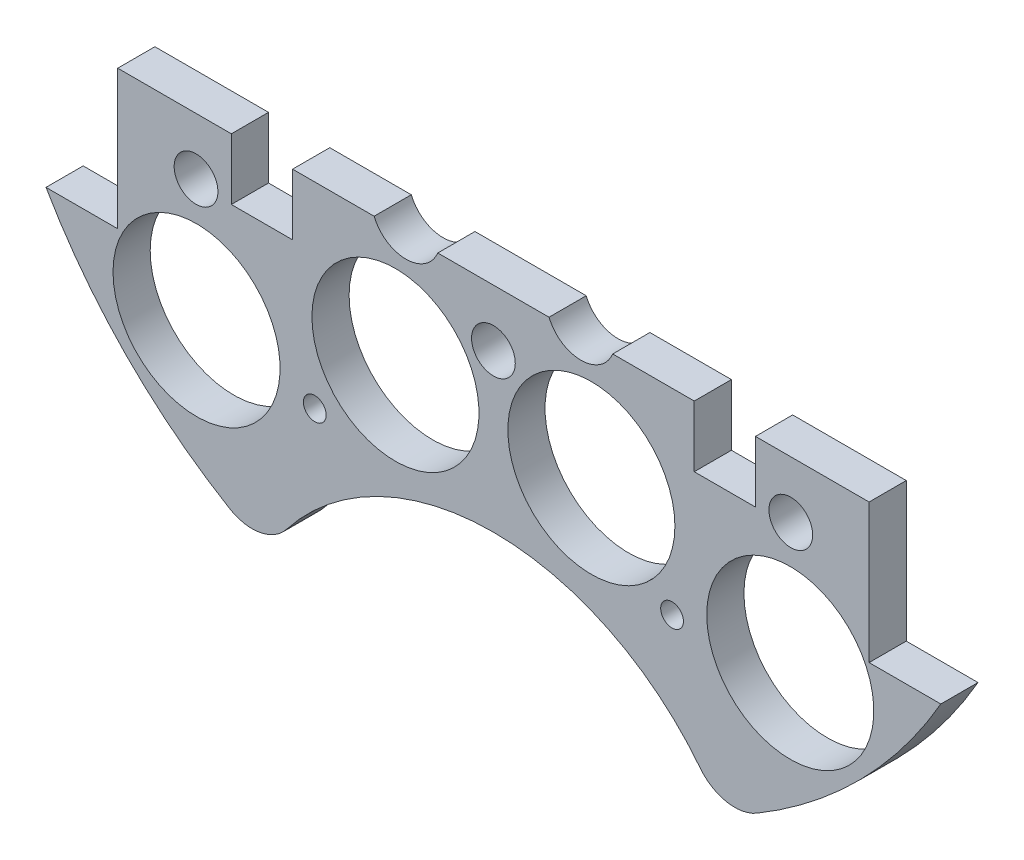
ISO-10303-21;
HEADER;
FILE_DESCRIPTION(('STEP AP214'),'2;1');
FILE_NAME('part.step','',(''),(''),'','','');
FILE_SCHEMA(('AUTOMOTIVE_DESIGN { 1 0 10303 214 1 1 1 1 }'));
ENDSEC;
DATA;
#1=APPLICATION_CONTEXT('core data for automotive mechanical design processes');
#2=APPLICATION_PROTOCOL_DEFINITION('international standard','automotive_design',2000,#1);
#3=PRODUCT_CONTEXT('',#1,'mechanical');
#4=PRODUCT('Part','Part','',(#3));
#5=PRODUCT_RELATED_PRODUCT_CATEGORY('part','',(#4));
#6=PRODUCT_DEFINITION_FORMATION('','',#4);
#7=PRODUCT_DEFINITION_CONTEXT('part definition',#1,'design');
#8=PRODUCT_DEFINITION('design','',#6,#7);
#9=PRODUCT_DEFINITION_SHAPE('','',#8);
#10=(LENGTH_UNIT() NAMED_UNIT(*) SI_UNIT(.MILLI.,.METRE.));
#11=(NAMED_UNIT(*) PLANE_ANGLE_UNIT() SI_UNIT($,.RADIAN.));
#12=(NAMED_UNIT(*) SI_UNIT($,.STERADIAN.) SOLID_ANGLE_UNIT());
#13=UNCERTAINTY_MEASURE_WITH_UNIT(LENGTH_MEASURE(1.E-05),#10,'distance_accuracy_value','');
#14=(GEOMETRIC_REPRESENTATION_CONTEXT(3) GLOBAL_UNCERTAINTY_ASSIGNED_CONTEXT((#13)) GLOBAL_UNIT_ASSIGNED_CONTEXT((#10,
#11,#12)) REPRESENTATION_CONTEXT('',''));
#15=CARTESIAN_POINT('',(0.,0.,0.));
#16=DIRECTION('',(0.,0.,1.));
#17=DIRECTION('',(1.,0.,0.));
#18=AXIS2_PLACEMENT_3D('',#15,#16,#17);
#19=CARTESIAN_POINT('',(85.0440360772851,-17.145,5.3975));
#20=DIRECTION('',(0.,-1.,0.));
#21=DIRECTION('',(0.,0.,-1.));
#22=AXIS2_PLACEMENT_3D('',#19,#20,#21);
#23=PLANE('',#22);
#24=DIRECTION('',(-1.,0.,0.));
#25=VECTOR('',#24,1.);
#26=CARTESIAN_POINT('',(85.0440360772851,-17.145,5.3975));
#27=LINE('',#26,#25);
#28=CARTESIAN_POINT('',(-17.3228751875862,-17.145,5.3975));
#29=VERTEX_POINT('',#28);
#30=CARTESIAN_POINT('',(-29.1604414737786,-17.145,5.3975));
#31=VERTEX_POINT('',#30);
#32=EDGE_CURVE('E197',#29,#31,#27,.T.);
#33=ORIENTED_EDGE('',*,*,#32,.F.);
#34=DIRECTION('',(0.,0.,-1.));
#35=VECTOR('',#34,1.);
#36=CARTESIAN_POINT('',(-17.3228751875862,-17.145,10.));
#37=LINE('',#36,#35);
#38=CARTESIAN_POINT('',(-17.3228751875862,-17.145,0.));
#39=VERTEX_POINT('',#38);
#40=EDGE_CURVE('E183',#29,#39,#37,.T.);
#41=ORIENTED_EDGE('',*,*,#40,.T.);
#42=DIRECTION('',(-1.,0.,0.));
#43=VECTOR('',#42,1.);
#44=CARTESIAN_POINT('',(85.0440360772851,-17.145,0.));
#45=LINE('',#44,#43);
#46=CARTESIAN_POINT('',(-29.1604414737786,-17.145,0.));
#47=VERTEX_POINT('',#46);
#48=EDGE_CURVE('E195',#39,#47,#45,.T.);
#49=ORIENTED_EDGE('',*,*,#48,.T.);
#50=DIRECTION('',(0.,0.,-1.));
#51=VECTOR('',#50,1.);
#52=CARTESIAN_POINT('',(-29.1604414737786,-17.145,5.3975));
#53=LINE('',#52,#51);
#54=EDGE_CURVE('E256',#31,#47,#53,.T.);
#55=ORIENTED_EDGE('',*,*,#54,.F.);
#56=EDGE_LOOP('',(#33,#41,#49,#55));
#57=FACE_BOUND('',#56,.T.);
#58=ADVANCED_FACE('F33',(#57),#23,.F.);
#59=CARTESIAN_POINT('',(8.07712481241381,-17.145,0.));
#60=VERTEX_POINT('',#59);
#61=CARTESIAN_POINT('',(-8.07712481241381,-17.145,0.));
#62=VERTEX_POINT('',#61);
#63=EDGE_CURVE('E205',#60,#62,#45,.T.);
#64=ORIENTED_EDGE('',*,*,#63,.T.);
#65=DIRECTION('',(0.,0.,-1.));
#66=VECTOR('',#65,1.);
#67=CARTESIAN_POINT('',(-8.07712481241381,-17.145,10.));
#68=LINE('',#67,#66);
#69=CARTESIAN_POINT('',(-8.07712481241381,-17.145,5.3975));
#70=VERTEX_POINT('',#69);
#71=EDGE_CURVE('E50',#62,#70,#68,.F.);
#72=ORIENTED_EDGE('',*,*,#71,.T.);
#73=CARTESIAN_POINT('',(8.07712481241381,-17.145,5.3975));
#74=VERTEX_POINT('',#73);
#75=EDGE_CURVE('E219',#74,#70,#27,.T.);
#76=ORIENTED_EDGE('',*,*,#75,.F.);
#77=DIRECTION('',(0.,0.,-1.));
#78=VECTOR('',#77,1.);
#79=CARTESIAN_POINT('',(8.07712481241381,-17.145,10.));
#80=LINE('',#79,#78);
#81=EDGE_CURVE('E238',#74,#60,#80,.T.);
#82=ORIENTED_EDGE('',*,*,#81,.T.);
#83=EDGE_LOOP('',(#64,#72,#76,#82));
#84=FACE_BOUND('',#83,.T.);
#85=ADVANCED_FACE('F304',(#84),#23,.F.);
#86=CARTESIAN_POINT('',(29.1604414737786,-17.145,0.));
#87=VERTEX_POINT('',#86);
#88=CARTESIAN_POINT('',(17.3228751875862,-17.145,0.));
#89=VERTEX_POINT('',#88);
#90=EDGE_CURVE('E209',#87,#89,#45,.T.);
#91=ORIENTED_EDGE('',*,*,#90,.T.);
#92=DIRECTION('',(0.,0.,-1.));
#93=VECTOR('',#92,1.);
#94=CARTESIAN_POINT('',(17.3228751875862,-17.145,10.));
#95=LINE('',#94,#93);
#96=CARTESIAN_POINT('',(17.3228751875862,-17.145,5.3975));
#97=VERTEX_POINT('',#96);
#98=EDGE_CURVE('E58',#89,#97,#95,.F.);
#99=ORIENTED_EDGE('',*,*,#98,.T.);
#100=CARTESIAN_POINT('',(29.1604414737786,-17.145,5.3975));
#101=VERTEX_POINT('',#100);
#102=EDGE_CURVE('E218',#101,#97,#27,.T.);
#103=ORIENTED_EDGE('',*,*,#102,.F.);
#104=DIRECTION('',(0.,0.,-1.));
#105=VECTOR('',#104,1.);
#106=CARTESIAN_POINT('',(29.1604414737786,-17.145,5.3975));
#107=LINE('',#106,#105);
#108=EDGE_CURVE('E227',#101,#87,#107,.T.);
#109=ORIENTED_EDGE('',*,*,#108,.T.);
#110=EDGE_LOOP('',(#91,#99,#103,#109));
#111=FACE_BOUND('',#110,.T.);
#112=ADVANCED_FACE('F224',(#111),#23,.F.);
#113=CARTESIAN_POINT('',(54.5504414737786,-17.145,0.));
#114=VERTEX_POINT('',#113);
#115=CARTESIAN_POINT('',(38.0504414737786,-17.145,0.));
#116=VERTEX_POINT('',#115);
#117=EDGE_CURVE('E208',#114,#116,#45,.T.);
#118=ORIENTED_EDGE('',*,*,#117,.T.);
#119=DIRECTION('',(0.,0.,-1.));
#120=VECTOR('',#119,1.);
#121=CARTESIAN_POINT('',(38.0504414737786,-17.145,5.3975));
#122=LINE('',#121,#120);
#123=CARTESIAN_POINT('',(38.0504414737786,-17.145,5.3975));
#124=VERTEX_POINT('',#123);
#125=EDGE_CURVE('E281',#124,#116,#122,.T.);
#126=ORIENTED_EDGE('',*,*,#125,.F.);
#127=CARTESIAN_POINT('',(54.5504414737786,-17.145,5.3975));
#128=VERTEX_POINT('',#127);
#129=EDGE_CURVE('E290',#128,#124,#27,.T.);
#130=ORIENTED_EDGE('',*,*,#129,.F.);
#131=DIRECTION('',(0.,0.,1.));
#132=VECTOR('',#131,1.);
#133=CARTESIAN_POINT('',(54.5504414737786,-17.145,5.3975));
#134=LINE('',#133,#132);
#135=EDGE_CURVE('E670',#114,#128,#134,.T.);
#136=ORIENTED_EDGE('',*,*,#135,.F.);
#137=EDGE_LOOP('',(#118,#126,#130,#136));
#138=FACE_BOUND('',#137,.T.);
#139=ADVANCED_FACE('F354',(#138),#23,.F.);
#140=CARTESIAN_POINT('',(0.,0.,5.3975));
#141=DIRECTION('',(0.,0.,-1.));
#142=DIRECTION('',(-1.,0.,0.));
#143=AXIS2_PLACEMENT_3D('',#140,#141,#142);
#144=CYLINDRICAL_SURFACE('',#143,74.93);
#145=CARTESIAN_POINT('',(0.,0.,0.));
#146=DIRECTION('',(0.,0.,1.));
#147=DIRECTION('',(1.,0.,0.));
#148=AXIS2_PLACEMENT_3D('',#145,#146,#147);
#149=CIRCLE('',#148,74.93);
#150=CARTESIAN_POINT('',(-64.9644414737785,-37.338,0.));
#151=VERTEX_POINT('',#150);
#152=CARTESIAN_POINT('',(-38.2787319784796,-64.4146223936749,0.));
#153=VERTEX_POINT('',#152);
#154=EDGE_CURVE('E652',#151,#153,#149,.T.);
#155=ORIENTED_EDGE('',*,*,#154,.T.);
#156=DIRECTION('',(0.,0.,-1.));
#157=VECTOR('',#156,1.);
#158=CARTESIAN_POINT('',(-38.2787319784796,-64.4146223936749,5.3975));
#159=LINE('',#158,#157);
#160=CARTESIAN_POINT('',(-38.2787319784796,-64.4146223936749,5.3975));
#161=VERTEX_POINT('',#160);
#162=EDGE_CURVE('E673',#153,#161,#159,.F.);
#163=ORIENTED_EDGE('',*,*,#162,.T.);
#164=CARTESIAN_POINT('',(0.,0.,5.3975));
#165=DIRECTION('',(0.,0.,1.));
#166=DIRECTION('',(1.,0.,0.));
#167=AXIS2_PLACEMENT_3D('',#164,#165,#166);
#168=CIRCLE('',#167,74.93);
#169=CARTESIAN_POINT('',(-64.9644414737785,-37.338,5.3975));
#170=VERTEX_POINT('',#169);
#171=EDGE_CURVE('E640',#170,#161,#168,.T.);
#172=ORIENTED_EDGE('',*,*,#171,.F.);
#173=DIRECTION('',(0.,0.,-1.));
#174=VECTOR('',#173,1.);
#175=CARTESIAN_POINT('',(-64.9644414737785,-37.338,5.3975));
#176=LINE('',#175,#174);
#177=EDGE_CURVE('E664',#170,#151,#176,.T.);
#178=ORIENTED_EDGE('',*,*,#177,.T.);
#179=EDGE_LOOP('',(#155,#163,#172,#178));
#180=FACE_BOUND('',#179,.T.);
#181=ADVANCED_FACE('F366',(#180),#144,.T.);
#182=CARTESIAN_POINT('',(0.,0.,5.3975));
#183=DIRECTION('',(0.,0.,1.));
#184=DIRECTION('',(1.,0.,0.));
#185=AXIS2_PLACEMENT_3D('',#182,#183,#184);
#186=PLANE('',#185);
#187=CARTESIAN_POINT('',(-25.9376089894497,-45.645229381132,5.3975));
#188=DIRECTION('',(0.,0.,1.));
#189=DIRECTION('',(1.,0.,0.));
#190=AXIS2_PLACEMENT_3D('',#187,#188,#189);
#191=CIRCLE('',#190,1.651);
#192=CARTESIAN_POINT('',(-24.2866089894497,-45.645229381132,5.3975));
#193=VERTEX_POINT('',#192);
#194=EDGE_CURVE('E322',#193,#193,#191,.T.);
#195=ORIENTED_EDGE('',*,*,#194,.F.);
#196=EDGE_LOOP('',(#195));
#197=FACE_BOUND('',#196,.T.);
#198=CARTESIAN_POINT('',(25.9376089894497,-45.645229381132,5.3975));
#199=DIRECTION('',(0.,0.,1.));
#200=DIRECTION('',(1.,0.,0.));
#201=AXIS2_PLACEMENT_3D('',#198,#199,#200);
#202=CIRCLE('',#201,1.651);
#203=CARTESIAN_POINT('',(27.5886089894497,-45.645229381132,5.3975));
#204=VERTEX_POINT('',#203);
#205=EDGE_CURVE('E318',#204,#204,#202,.T.);
#206=ORIENTED_EDGE('',*,*,#205,.F.);
#207=EDGE_LOOP('',(#206));
#208=FACE_BOUND('',#207,.T.);
#209=CARTESIAN_POINT('',(-43.18,-25.4,5.3975));
#210=DIRECTION('',(0.,0.,1.));
#211=DIRECTION('',(1.,0.,0.));
#212=AXIS2_PLACEMENT_3D('',#209,#210,#211);
#213=CIRCLE('',#212,3.175);
#214=CARTESIAN_POINT('',(-40.005,-25.4,5.3975));
#215=VERTEX_POINT('',#214);
#216=EDGE_CURVE('E190',#215,#215,#213,.F.);
#217=ORIENTED_EDGE('',*,*,#216,.T.);
#218=EDGE_LOOP('',(#217));
#219=FACE_BOUND('',#218,.T.);
#220=CARTESIAN_POINT('',(0.,-25.4,5.3975));
#221=DIRECTION('',(0.,0.,1.));
#222=DIRECTION('',(1.,0.,0.));
#223=AXIS2_PLACEMENT_3D('',#220,#221,#222);
#224=CIRCLE('',#223,3.175);
#225=CARTESIAN_POINT('',(3.17500000000001,-25.4,5.3975));
#226=VERTEX_POINT('',#225);
#227=EDGE_CURVE('E310',#226,#226,#224,.F.);
#228=ORIENTED_EDGE('',*,*,#227,.T.);
#229=EDGE_LOOP('',(#228));
#230=FACE_BOUND('',#229,.T.);
#231=CARTESIAN_POINT('',(43.18,-25.4,5.3975));
#232=DIRECTION('',(0.,0.,1.));
#233=DIRECTION('',(1.,0.,0.));
#234=AXIS2_PLACEMENT_3D('',#231,#232,#233);
#235=CIRCLE('',#234,3.175);
#236=CARTESIAN_POINT('',(46.355,-25.4,5.3975));
#237=VERTEX_POINT('',#236);
#238=EDGE_CURVE('E314',#237,#237,#235,.F.);
#239=ORIENTED_EDGE('',*,*,#238,.T.);
#240=EDGE_LOOP('',(#239));
#241=FACE_BOUND('',#240,.T.);
#242=CARTESIAN_POINT('',(-12.7,-15.24,5.3975));
#243=DIRECTION('',(0.,0.,1.));
#244=DIRECTION('',(1.,0.,0.));
#245=AXIS2_PLACEMENT_3D('',#242,#243,#244);
#246=CIRCLE('',#245,5.);
#247=EDGE_CURVE('E189',#29,#70,#246,.T.);
#248=ORIENTED_EDGE('',*,*,#247,.F.);
#249=ORIENTED_EDGE('',*,*,#32,.T.);
#250=DIRECTION('',(0.,-1.,0.));
#251=VECTOR('',#250,1.);
#252=CARTESIAN_POINT('',(-29.1604414737786,-17.145,5.3975));
#253=LINE('',#252,#251);
#254=CARTESIAN_POINT('',(-29.1604414737786,-26.035,5.3975));
#255=VERTEX_POINT('',#254);
#256=EDGE_CURVE('E240',#31,#255,#253,.T.);
#257=ORIENTED_EDGE('',*,*,#256,.T.);
#258=DIRECTION('',(-1.,0.,0.));
#259=VECTOR('',#258,1.);
#260=CARTESIAN_POINT('',(-29.1604414737786,-26.035,5.3975));
#261=LINE('',#260,#259);
#262=CARTESIAN_POINT('',(-38.0504414737786,-26.035,5.3975));
#263=VERTEX_POINT('',#262);
#264=EDGE_CURVE('E243',#255,#263,#261,.T.);
#265=ORIENTED_EDGE('',*,*,#264,.T.);
#266=DIRECTION('',(0.,1.,0.));
#267=VECTOR('',#266,1.);
#268=CARTESIAN_POINT('',(-38.0504414737786,-17.145,5.3975));
#269=LINE('',#268,#267);
#270=CARTESIAN_POINT('',(-38.0504414737786,-17.145,5.3975));
#271=VERTEX_POINT('',#270);
#272=EDGE_CURVE('E247',#263,#271,#269,.T.);
#273=ORIENTED_EDGE('',*,*,#272,.T.);
#274=CARTESIAN_POINT('',(-54.5504414737786,-17.145,5.3975));
#275=VERTEX_POINT('',#274);
#276=EDGE_CURVE('E214',#271,#275,#27,.T.);
#277=ORIENTED_EDGE('',*,*,#276,.T.);
#278=DIRECTION('',(0.,-1.,0.));
#279=VECTOR('',#278,1.);
#280=CARTESIAN_POINT('',(-54.5504414737786,37.338,5.3975));
#281=LINE('',#280,#279);
#282=CARTESIAN_POINT('',(-54.5504414737786,-37.338,5.3975));
#283=VERTEX_POINT('',#282);
#284=EDGE_CURVE('E634',#275,#283,#281,.T.);
#285=ORIENTED_EDGE('',*,*,#284,.T.);
#286=DIRECTION('',(-1.,0.,0.));
#287=VECTOR('',#286,1.);
#288=CARTESIAN_POINT('',(-64.9644414737785,-37.338,5.3975));
#289=LINE('',#288,#287);
#290=EDGE_CURVE('E636',#283,#170,#289,.T.);
#291=ORIENTED_EDGE('',*,*,#290,.T.);
#292=ORIENTED_EDGE('',*,*,#171,.T.);
#293=CARTESIAN_POINT('',(-35.0347716413203,-58.9557560891262,5.3975));
#294=DIRECTION('',(0.,0.,1.));
#295=DIRECTION('',(1.,0.,0.));
#296=AXIS2_PLACEMENT_3D('',#293,#294,#295);
#297=CIRCLE('',#296,6.35);
#298=CARTESIAN_POINT('',(-30.0298042639888,-62.8637992761762,5.3975));
#299=VERTEX_POINT('',#298);
#300=EDGE_CURVE('E676',#161,#299,#297,.T.);
#301=ORIENTED_EDGE('',*,*,#300,.T.);
#302=CARTESIAN_POINT('',(0.,-86.312058398476,5.3975));
#303=DIRECTION('',(0.,0.,1.));
#304=DIRECTION('',(1.,0.,0.));
#305=AXIS2_PLACEMENT_3D('',#302,#303,#304);
#306=CIRCLE('',#305,38.1);
#307=CARTESIAN_POINT('',(30.0298042639888,-62.8637992761762,5.3975));
#308=VERTEX_POINT('',#307);
#309=EDGE_CURVE('E210',#308,#299,#306,.T.);
#310=ORIENTED_EDGE('',*,*,#309,.F.);
#311=CARTESIAN_POINT('',(35.0347716413203,-58.9557560891262,5.3975));
#312=DIRECTION('',(0.,0.,1.));
#313=DIRECTION('',(1.,0.,0.));
#314=AXIS2_PLACEMENT_3D('',#311,#312,#313);
#315=CIRCLE('',#314,6.35);
#316=CARTESIAN_POINT('',(38.2787319784796,-64.4146223936749,5.3975));
#317=VERTEX_POINT('',#316);
#318=EDGE_CURVE('E11',#308,#317,#315,.T.);
#319=ORIENTED_EDGE('',*,*,#318,.T.);
#320=CARTESIAN_POINT('',(64.9644414737785,-37.338,5.3975));
#321=VERTEX_POINT('',#320);
#322=EDGE_CURVE('E639',#317,#321,#168,.T.);
#323=ORIENTED_EDGE('',*,*,#322,.T.);
#324=DIRECTION('',(-1.,0.,0.));
#325=VECTOR('',#324,1.);
#326=CARTESIAN_POINT('',(64.9644414737785,-37.338,5.3975));
#327=LINE('',#326,#325);
#328=CARTESIAN_POINT('',(54.5504414737786,-37.338,5.3975));
#329=VERTEX_POINT('',#328);
#330=EDGE_CURVE('E643',#321,#329,#327,.T.);
#331=ORIENTED_EDGE('',*,*,#330,.T.);
#332=DIRECTION('',(0.,1.,0.));
#333=VECTOR('',#332,1.);
#334=CARTESIAN_POINT('',(54.5504414737786,37.338,5.3975));
#335=LINE('',#334,#333);
#336=EDGE_CURVE('E645',#329,#128,#335,.T.);
#337=ORIENTED_EDGE('',*,*,#336,.T.);
#338=ORIENTED_EDGE('',*,*,#129,.T.);
#339=DIRECTION('',(0.,-1.,0.));
#340=VECTOR('',#339,1.);
#341=CARTESIAN_POINT('',(38.0504414737786,-17.145,5.3975));
#342=LINE('',#341,#340);
#343=CARTESIAN_POINT('',(38.0504414737786,-26.035,5.3975));
#344=VERTEX_POINT('',#343);
#345=EDGE_CURVE('E265',#124,#344,#342,.T.);
#346=ORIENTED_EDGE('',*,*,#345,.T.);
#347=DIRECTION('',(-1.,0.,0.));
#348=VECTOR('',#347,1.);
#349=CARTESIAN_POINT('',(38.0504414737786,-26.035,5.3975));
#350=LINE('',#349,#348);
#351=CARTESIAN_POINT('',(29.1604414737786,-26.035,5.3975));
#352=VERTEX_POINT('',#351);
#353=EDGE_CURVE('E268',#344,#352,#350,.T.);
#354=ORIENTED_EDGE('',*,*,#353,.T.);
#355=DIRECTION('',(0.,1.,0.));
#356=VECTOR('',#355,1.);
#357=CARTESIAN_POINT('',(29.1604414737786,-17.145,5.3975));
#358=LINE('',#357,#356);
#359=EDGE_CURVE('E271',#352,#101,#358,.T.);
#360=ORIENTED_EDGE('',*,*,#359,.T.);
#361=ORIENTED_EDGE('',*,*,#102,.T.);
#362=CARTESIAN_POINT('',(12.7,-15.24,5.3975));
#363=DIRECTION('',(0.,0.,1.));
#364=DIRECTION('',(1.,0.,0.));
#365=AXIS2_PLACEMENT_3D('',#362,#363,#364);
#366=CIRCLE('',#365,5.);
#367=EDGE_CURVE('E232',#74,#97,#366,.T.);
#368=ORIENTED_EDGE('',*,*,#367,.F.);
#369=ORIENTED_EDGE('',*,*,#75,.T.);
#370=EDGE_LOOP('',(#248,#249,#257,#265,#273,#277,#285,#291,#292,#301,#310,#319,#323,#331,#337,
#338,#346,#354,#360,#361,#368,#369));
#371=FACE_BOUND('',#370,.T.);
#372=CARTESIAN_POINT('',(-43.105229381132,-43.1052293811318,5.3975));
#373=DIRECTION('',(0.,0.,-1.));
#374=DIRECTION('',(-1.,0.,0.));
#375=AXIS2_PLACEMENT_3D('',#372,#373,#374);
#376=CIRCLE('',#375,12.1285);
#377=CARTESIAN_POINT('',(-55.233729381132,-43.1052293811318,5.3975));
#378=VERTEX_POINT('',#377);
#379=EDGE_CURVE('E722',#378,#378,#376,.T.);
#380=ORIENTED_EDGE('',*,*,#379,.T.);
#381=EDGE_LOOP('',(#380));
#382=FACE_BOUND('',#381,.T.);
#383=CARTESIAN_POINT('',(14.224,-34.29,5.3975));
#384=DIRECTION('',(0.,0.,-1.));
#385=DIRECTION('',(1.,0.,0.));
#386=AXIS2_PLACEMENT_3D('',#383,#384,#385);
#387=CIRCLE('',#386,12.1285);
#388=CARTESIAN_POINT('',(26.3525,-34.29,5.3975));
#389=VERTEX_POINT('',#388);
#390=EDGE_CURVE('E719',#389,#389,#387,.T.);
#391=ORIENTED_EDGE('',*,*,#390,.T.);
#392=EDGE_LOOP('',(#391));
#393=FACE_BOUND('',#392,.T.);
#394=CARTESIAN_POINT('',(43.1052293811319,-43.105229381132,5.3975));
#395=DIRECTION('',(0.,0.,-1.));
#396=DIRECTION('',(-1.,0.,0.));
#397=AXIS2_PLACEMENT_3D('',#394,#395,#396);
#398=CIRCLE('',#397,12.1285);
#399=CARTESIAN_POINT('',(30.9767293811319,-43.105229381132,5.3975));
#400=VERTEX_POINT('',#399);
#401=EDGE_CURVE('E625',#400,#400,#398,.T.);
#402=ORIENTED_EDGE('',*,*,#401,.T.);
#403=EDGE_LOOP('',(#402));
#404=FACE_BOUND('',#403,.T.);
#405=CARTESIAN_POINT('',(-14.224,-34.29,5.3975));
#406=DIRECTION('',(0.,0.,-1.));
#407=DIRECTION('',(-1.,0.,0.));
#408=AXIS2_PLACEMENT_3D('',#405,#406,#407);
#409=CIRCLE('',#408,12.1285);
#410=CARTESIAN_POINT('',(-26.3525,-34.29,5.3975));
#411=VERTEX_POINT('',#410);
#412=EDGE_CURVE('E624',#411,#411,#409,.T.);
#413=ORIENTED_EDGE('',*,*,#412,.T.);
#414=EDGE_LOOP('',(#413));
#415=FACE_BOUND('',#414,.T.);
#416=ADVANCED_FACE('F301',(#197,#208,#219,#230,#241,#371,#382,#393,#404,#415),#186,.T.);
#417=CARTESIAN_POINT('',(0.,0.,0.));
#418=DIRECTION('',(0.,0.,1.));
#419=DIRECTION('',(1.,0.,0.));
#420=AXIS2_PLACEMENT_3D('',#417,#418,#419);
#421=PLANE('',#420);
#422=CARTESIAN_POINT('',(-25.9376089894497,-45.645229381132,0.));
#423=DIRECTION('',(0.,0.,1.));
#424=DIRECTION('',(1.,0.,0.));
#425=AXIS2_PLACEMENT_3D('',#422,#423,#424);
#426=CIRCLE('',#425,1.651);
#427=CARTESIAN_POINT('',(-24.2866089894497,-45.645229381132,0.));
#428=VERTEX_POINT('',#427);
#429=EDGE_CURVE('E37',#428,#428,#426,.T.);
#430=ORIENTED_EDGE('',*,*,#429,.T.);
#431=EDGE_LOOP('',(#430));
#432=FACE_BOUND('',#431,.T.);
#433=CARTESIAN_POINT('',(25.9376089894497,-45.645229381132,0.));
#434=DIRECTION('',(0.,0.,1.));
#435=DIRECTION('',(1.,0.,0.));
#436=AXIS2_PLACEMENT_3D('',#433,#434,#435);
#437=CIRCLE('',#436,1.651);
#438=CARTESIAN_POINT('',(27.5886089894497,-45.645229381132,0.));
#439=VERTEX_POINT('',#438);
#440=EDGE_CURVE('E321',#439,#439,#437,.T.);
#441=ORIENTED_EDGE('',*,*,#440,.T.);
#442=EDGE_LOOP('',(#441));
#443=FACE_BOUND('',#442,.T.);
#444=CARTESIAN_POINT('',(-43.18,-25.4,0.));
#445=DIRECTION('',(0.,0.,1.));
#446=DIRECTION('',(1.,0.,0.));
#447=AXIS2_PLACEMENT_3D('',#444,#445,#446);
#448=CIRCLE('',#447,3.175);
#449=CARTESIAN_POINT('',(-40.005,-25.4,0.));
#450=VERTEX_POINT('',#449);
#451=EDGE_CURVE('E309',#450,#450,#448,.F.);
#452=ORIENTED_EDGE('',*,*,#451,.F.);
#453=EDGE_LOOP('',(#452));
#454=FACE_BOUND('',#453,.T.);
#455=CARTESIAN_POINT('',(0.,-25.4,0.));
#456=DIRECTION('',(0.,0.,1.));
#457=DIRECTION('',(1.,0.,0.));
#458=AXIS2_PLACEMENT_3D('',#455,#456,#457);
#459=CIRCLE('',#458,3.175);
#460=CARTESIAN_POINT('',(3.17500000000001,-25.4,0.));
#461=VERTEX_POINT('',#460);
#462=EDGE_CURVE('E313',#461,#461,#459,.F.);
#463=ORIENTED_EDGE('',*,*,#462,.F.);
#464=EDGE_LOOP('',(#463));
#465=FACE_BOUND('',#464,.T.);
#466=CARTESIAN_POINT('',(43.18,-25.4,0.));
#467=DIRECTION('',(0.,0.,1.));
#468=DIRECTION('',(1.,0.,0.));
#469=AXIS2_PLACEMENT_3D('',#466,#467,#468);
#470=CIRCLE('',#469,3.175);
#471=CARTESIAN_POINT('',(46.355,-25.4,0.));
#472=VERTEX_POINT('',#471);
#473=EDGE_CURVE('E317',#472,#472,#470,.F.);
#474=ORIENTED_EDGE('',*,*,#473,.F.);
#475=EDGE_LOOP('',(#474));
#476=FACE_BOUND('',#475,.T.);
#477=CARTESIAN_POINT('',(-43.105229381132,-43.1052293811318,0.));
#478=DIRECTION('',(0.,0.,-1.));
#479=DIRECTION('',(-1.,0.,0.));
#480=AXIS2_PLACEMENT_3D('',#477,#478,#479);
#481=CIRCLE('',#480,12.1285);
#482=CARTESIAN_POINT('',(-55.233729381132,-43.1052293811318,0.));
#483=VERTEX_POINT('',#482);
#484=EDGE_CURVE('E296',#483,#483,#481,.T.);
#485=ORIENTED_EDGE('',*,*,#484,.F.);
#486=EDGE_LOOP('',(#485));
#487=FACE_BOUND('',#486,.T.);
#488=CARTESIAN_POINT('',(14.224,-34.29,0.));
#489=DIRECTION('',(0.,0.,-1.));
#490=DIRECTION('',(1.,0.,0.));
#491=AXIS2_PLACEMENT_3D('',#488,#489,#490);
#492=CIRCLE('',#491,12.1285);
#493=CARTESIAN_POINT('',(26.3525,-34.29,0.));
#494=VERTEX_POINT('',#493);
#495=EDGE_CURVE('E615',#494,#494,#492,.T.);
#496=ORIENTED_EDGE('',*,*,#495,.F.);
#497=EDGE_LOOP('',(#496));
#498=FACE_BOUND('',#497,.T.);
#499=CARTESIAN_POINT('',(43.1052293811319,-43.105229381132,0.));
#500=DIRECTION('',(0.,0.,-1.));
#501=DIRECTION('',(-1.,0.,0.));
#502=AXIS2_PLACEMENT_3D('',#499,#500,#501);
#503=CIRCLE('',#502,12.1285);
#504=CARTESIAN_POINT('',(30.9767293811319,-43.105229381132,0.));
#505=VERTEX_POINT('',#504);
#506=EDGE_CURVE('E619',#505,#505,#503,.T.);
#507=ORIENTED_EDGE('',*,*,#506,.F.);
#508=EDGE_LOOP('',(#507));
#509=FACE_BOUND('',#508,.T.);
#510=CARTESIAN_POINT('',(-14.224,-34.29,0.));
#511=DIRECTION('',(0.,0.,-1.));
#512=DIRECTION('',(-1.,0.,0.));
#513=AXIS2_PLACEMENT_3D('',#510,#511,#512);
#514=CIRCLE('',#513,12.1285);
#515=CARTESIAN_POINT('',(-26.3525,-34.29,0.));
#516=VERTEX_POINT('',#515);
#517=EDGE_CURVE('E622',#516,#516,#514,.T.);
#518=ORIENTED_EDGE('',*,*,#517,.F.);
#519=EDGE_LOOP('',(#518));
#520=FACE_BOUND('',#519,.T.);
#521=ORIENTED_EDGE('',*,*,#48,.F.);
#522=CARTESIAN_POINT('',(-12.7,-15.24,0.));
#523=DIRECTION('',(0.,0.,-1.));
#524=DIRECTION('',(1.,0.,0.));
#525=AXIS2_PLACEMENT_3D('',#522,#523,#524);
#526=CIRCLE('',#525,5.);
#527=EDGE_CURVE('E180',#62,#39,#526,.T.);
#528=ORIENTED_EDGE('',*,*,#527,.F.);
#529=ORIENTED_EDGE('',*,*,#63,.F.);
#530=CARTESIAN_POINT('',(12.7,-15.24,0.));
#531=DIRECTION('',(0.,0.,-1.));
#532=DIRECTION('',(-1.,0.,0.));
#533=AXIS2_PLACEMENT_3D('',#530,#531,#532);
#534=CIRCLE('',#533,5.);
#535=EDGE_CURVE('E198',#89,#60,#534,.T.);
#536=ORIENTED_EDGE('',*,*,#535,.F.);
#537=ORIENTED_EDGE('',*,*,#90,.F.);
#538=DIRECTION('',(0.,1.,0.));
#539=VECTOR('',#538,1.);
#540=CARTESIAN_POINT('',(29.1604414737786,-17.145,0.));
#541=LINE('',#540,#539);
#542=CARTESIAN_POINT('',(29.1604414737786,-26.035,0.));
#543=VERTEX_POINT('',#542);
#544=EDGE_CURVE('E230',#543,#87,#541,.T.);
#545=ORIENTED_EDGE('',*,*,#544,.F.);
#546=DIRECTION('',(-1.,0.,0.));
#547=VECTOR('',#546,1.);
#548=CARTESIAN_POINT('',(38.0504414737786,-26.035,0.));
#549=LINE('',#548,#547);
#550=CARTESIAN_POINT('',(38.0504414737786,-26.035,0.));
#551=VERTEX_POINT('',#550);
#552=EDGE_CURVE('E277',#551,#543,#549,.T.);
#553=ORIENTED_EDGE('',*,*,#552,.F.);
#554=DIRECTION('',(0.,-1.,0.));
#555=VECTOR('',#554,1.);
#556=CARTESIAN_POINT('',(38.0504414737786,-17.145,0.));
#557=LINE('',#556,#555);
#558=EDGE_CURVE('E258',#116,#551,#557,.T.);
#559=ORIENTED_EDGE('',*,*,#558,.F.);
#560=ORIENTED_EDGE('',*,*,#117,.F.);
#561=DIRECTION('',(0.,1.,0.));
#562=VECTOR('',#561,1.);
#563=CARTESIAN_POINT('',(54.5504414737786,37.338,0.));
#564=LINE('',#563,#562);
#565=CARTESIAN_POINT('',(54.5504414737786,-37.338,0.));
#566=VERTEX_POINT('',#565);
#567=EDGE_CURVE('E637',#566,#114,#564,.T.);
#568=ORIENTED_EDGE('',*,*,#567,.F.);
#569=DIRECTION('',(-1.,0.,0.));
#570=VECTOR('',#569,1.);
#571=CARTESIAN_POINT('',(64.9644414737785,-37.338,0.));
#572=LINE('',#571,#570);
#573=CARTESIAN_POINT('',(64.9644414737785,-37.338,0.));
#574=VERTEX_POINT('',#573);
#575=EDGE_CURVE('E655',#574,#566,#572,.T.);
#576=ORIENTED_EDGE('',*,*,#575,.F.);
#577=CARTESIAN_POINT('',(38.2787319784796,-64.4146223936749,0.));
#578=VERTEX_POINT('',#577);
#579=EDGE_CURVE('E651',#578,#574,#149,.T.);
#580=ORIENTED_EDGE('',*,*,#579,.F.);
#581=CARTESIAN_POINT('',(35.0347716413203,-58.9557560891262,0.));
#582=DIRECTION('',(0.,0.,1.));
#583=DIRECTION('',(1.,0.,0.));
#584=AXIS2_PLACEMENT_3D('',#581,#582,#583);
#585=CIRCLE('',#584,6.35);
#586=CARTESIAN_POINT('',(30.0298042639888,-62.8637992761762,0.));
#587=VERTEX_POINT('',#586);
#588=EDGE_CURVE('E686',#578,#587,#585,.F.);
#589=ORIENTED_EDGE('',*,*,#588,.T.);
#590=CARTESIAN_POINT('',(0.,-86.312058398476,0.));
#591=DIRECTION('',(0.,0.,-1.));
#592=DIRECTION('',(-1.,0.,0.));
#593=AXIS2_PLACEMENT_3D('',#590,#591,#592);
#594=CIRCLE('',#593,38.1);
#595=CARTESIAN_POINT('',(-30.0298042639888,-62.8637992761762,0.));
#596=VERTEX_POINT('',#595);
#597=EDGE_CURVE('E283',#596,#587,#594,.T.);
#598=ORIENTED_EDGE('',*,*,#597,.F.);
#599=CARTESIAN_POINT('',(-35.0347716413203,-58.9557560891262,0.));
#600=DIRECTION('',(0.,0.,1.));
#601=DIRECTION('',(1.,0.,0.));
#602=AXIS2_PLACEMENT_3D('',#599,#600,#601);
#603=CIRCLE('',#602,6.35);
#604=EDGE_CURVE('E681',#596,#153,#603,.F.);
#605=ORIENTED_EDGE('',*,*,#604,.T.);
#606=ORIENTED_EDGE('',*,*,#154,.F.);
#607=DIRECTION('',(-1.,0.,0.));
#608=VECTOR('',#607,1.);
#609=CARTESIAN_POINT('',(-64.9644414737785,-37.338,0.));
#610=LINE('',#609,#608);
#611=CARTESIAN_POINT('',(-54.5504414737786,-37.338,0.));
#612=VERTEX_POINT('',#611);
#613=EDGE_CURVE('E649',#612,#151,#610,.T.);
#614=ORIENTED_EDGE('',*,*,#613,.F.);
#615=DIRECTION('',(0.,-1.,0.));
#616=VECTOR('',#615,1.);
#617=CARTESIAN_POINT('',(-54.5504414737786,37.338,0.));
#618=LINE('',#617,#616);
#619=CARTESIAN_POINT('',(-54.5504414737786,-17.145,0.));
#620=VERTEX_POINT('',#619);
#621=EDGE_CURVE('E628',#620,#612,#618,.T.);
#622=ORIENTED_EDGE('',*,*,#621,.F.);
#623=CARTESIAN_POINT('',(-38.0504414737786,-17.145,0.));
#624=VERTEX_POINT('',#623);
#625=EDGE_CURVE('E206',#624,#620,#45,.T.);
#626=ORIENTED_EDGE('',*,*,#625,.F.);
#627=DIRECTION('',(0.,1.,0.));
#628=VECTOR('',#627,1.);
#629=CARTESIAN_POINT('',(-38.0504414737786,-17.145,0.));
#630=LINE('',#629,#628);
#631=CARTESIAN_POINT('',(-38.0504414737786,-26.035,0.));
#632=VERTEX_POINT('',#631);
#633=EDGE_CURVE('E244',#632,#624,#630,.T.);
#634=ORIENTED_EDGE('',*,*,#633,.F.);
#635=DIRECTION('',(-1.,0.,0.));
#636=VECTOR('',#635,1.);
#637=CARTESIAN_POINT('',(-29.1604414737786,-26.035,0.));
#638=LINE('',#637,#636);
#639=CARTESIAN_POINT('',(-29.1604414737786,-26.035,0.));
#640=VERTEX_POINT('',#639);
#641=EDGE_CURVE('E252',#640,#632,#638,.T.);
#642=ORIENTED_EDGE('',*,*,#641,.F.);
#643=DIRECTION('',(0.,-1.,0.));
#644=VECTOR('',#643,1.);
#645=CARTESIAN_POINT('',(-29.1604414737786,-17.145,0.));
#646=LINE('',#645,#644);
#647=EDGE_CURVE('E204',#47,#640,#646,.T.);
#648=ORIENTED_EDGE('',*,*,#647,.F.);
#649=EDGE_LOOP('',(#521,#528,#529,#536,#537,#545,#553,#559,#560,#568,#576,#580,#589,#598,#605,
#606,#614,#622,#626,#634,#642,#648));
#650=FACE_BOUND('',#649,.T.);
#651=ADVANCED_FACE('F201',(#432,#443,#454,#465,#476,#487,#498,#509,#520,#650),#421,.F.);
#652=CARTESIAN_POINT('',(-54.5504414737786,37.338,5.3975));
#653=DIRECTION('',(1.,0.,0.));
#654=DIRECTION('',(0.,1.,0.));
#655=AXIS2_PLACEMENT_3D('',#652,#653,#654);
#656=PLANE('',#655);
#657=ORIENTED_EDGE('',*,*,#284,.F.);
#658=DIRECTION('',(0.,0.,-1.));
#659=VECTOR('',#658,1.);
#660=CARTESIAN_POINT('',(-54.5504414737786,-17.145,5.3975));
#661=LINE('',#660,#659);
#662=EDGE_CURVE('E292',#275,#620,#661,.T.);
#663=ORIENTED_EDGE('',*,*,#662,.T.);
#664=ORIENTED_EDGE('',*,*,#621,.T.);
#665=DIRECTION('',(0.,0.,-1.));
#666=VECTOR('',#665,1.);
#667=CARTESIAN_POINT('',(-54.5504414737786,-37.338,5.3975));
#668=LINE('',#667,#666);
#669=EDGE_CURVE('E667',#283,#612,#668,.T.);
#670=ORIENTED_EDGE('',*,*,#669,.F.);
#671=EDGE_LOOP('',(#657,#663,#664,#670));
#672=FACE_BOUND('',#671,.T.);
#673=ADVANCED_FACE('F518',(#672),#656,.F.);
#674=CARTESIAN_POINT('',(-64.9644414737785,-37.338,5.3975));
#675=DIRECTION('',(0.,-1.,0.));
#676=DIRECTION('',(0.,0.,-1.));
#677=AXIS2_PLACEMENT_3D('',#674,#675,#676);
#678=PLANE('',#677);
#679=ORIENTED_EDGE('',*,*,#613,.T.);
#680=ORIENTED_EDGE('',*,*,#177,.F.);
#681=ORIENTED_EDGE('',*,*,#290,.F.);
#682=ORIENTED_EDGE('',*,*,#669,.T.);
#683=EDGE_LOOP('',(#679,#680,#681,#682));
#684=FACE_BOUND('',#683,.T.);
#685=ADVANCED_FACE('F484',(#684),#678,.F.);
#686=ORIENTED_EDGE('',*,*,#322,.F.);
#687=DIRECTION('',(0.,0.,-1.));
#688=VECTOR('',#687,1.);
#689=CARTESIAN_POINT('',(38.2787319784796,-64.4146223936749,5.3975));
#690=LINE('',#689,#688);
#691=EDGE_CURVE('E683',#317,#578,#690,.T.);
#692=ORIENTED_EDGE('',*,*,#691,.T.);
#693=ORIENTED_EDGE('',*,*,#579,.T.);
#694=DIRECTION('',(0.,0.,-1.));
#695=VECTOR('',#694,1.);
#696=CARTESIAN_POINT('',(64.9644414737785,-37.338,5.3975));
#697=LINE('',#696,#695);
#698=EDGE_CURVE('E661',#321,#574,#697,.T.);
#699=ORIENTED_EDGE('',*,*,#698,.F.);
#700=EDGE_LOOP('',(#686,#692,#693,#699));
#701=FACE_BOUND('',#700,.T.);
#702=ADVANCED_FACE('F373',(#701),#144,.T.);
#703=CARTESIAN_POINT('',(64.9644414737785,-37.338,5.3975));
#704=DIRECTION('',(0.,-1.,0.));
#705=DIRECTION('',(0.,0.,-1.));
#706=AXIS2_PLACEMENT_3D('',#703,#704,#705);
#707=PLANE('',#706);
#708=ORIENTED_EDGE('',*,*,#575,.T.);
#709=DIRECTION('',(0.,0.,-1.));
#710=VECTOR('',#709,1.);
#711=CARTESIAN_POINT('',(54.5504414737786,-37.338,5.3975));
#712=LINE('',#711,#710);
#713=EDGE_CURVE('E647',#329,#566,#712,.T.);
#714=ORIENTED_EDGE('',*,*,#713,.F.);
#715=ORIENTED_EDGE('',*,*,#330,.F.);
#716=ORIENTED_EDGE('',*,*,#698,.T.);
#717=EDGE_LOOP('',(#708,#714,#715,#716));
#718=FACE_BOUND('',#717,.T.);
#719=ADVANCED_FACE('F483',(#718),#707,.F.);
#720=CARTESIAN_POINT('',(54.5504414737786,37.338,5.3975));
#721=DIRECTION('',(-1.,0.,0.));
#722=DIRECTION('',(0.,-1.,0.));
#723=AXIS2_PLACEMENT_3D('',#720,#721,#722);
#724=PLANE('',#723);
#725=ORIENTED_EDGE('',*,*,#567,.T.);
#726=ORIENTED_EDGE('',*,*,#135,.T.);
#727=ORIENTED_EDGE('',*,*,#336,.F.);
#728=ORIENTED_EDGE('',*,*,#713,.T.);
#729=EDGE_LOOP('',(#725,#726,#727,#728));
#730=FACE_BOUND('',#729,.T.);
#731=ADVANCED_FACE('F505',(#730),#724,.F.);
#732=CARTESIAN_POINT('',(-14.224,-34.29,5.3975));
#733=DIRECTION('',(0.,0.,-1.));
#734=DIRECTION('',(-1.,0.,0.));
#735=AXIS2_PLACEMENT_3D('',#732,#733,#734);
#736=CYLINDRICAL_SURFACE('',#735,12.1285);
#737=ORIENTED_EDGE('',*,*,#412,.F.);
#738=EDGE_LOOP('',(#737));
#739=FACE_BOUND('',#738,.T.);
#740=ORIENTED_EDGE('',*,*,#517,.T.);
#741=EDGE_LOOP('',(#740));
#742=FACE_BOUND('',#741,.T.);
#743=ADVANCED_FACE('F510',(#739,#742),#736,.F.);
#744=CARTESIAN_POINT('',(43.1052293811319,-43.105229381132,5.3975));
#745=DIRECTION('',(0.,0.,-1.));
#746=DIRECTION('',(-1.,0.,0.));
#747=AXIS2_PLACEMENT_3D('',#744,#745,#746);
#748=CYLINDRICAL_SURFACE('',#747,12.1285);
#749=ORIENTED_EDGE('',*,*,#401,.F.);
#750=EDGE_LOOP('',(#749));
#751=FACE_BOUND('',#750,.T.);
#752=ORIENTED_EDGE('',*,*,#506,.T.);
#753=EDGE_LOOP('',(#752));
#754=FACE_BOUND('',#753,.T.);
#755=ADVANCED_FACE('F541',(#751,#754),#748,.F.);
#756=CARTESIAN_POINT('',(14.224,-34.29,5.3975));
#757=DIRECTION('',(0.,0.,-1.));
#758=DIRECTION('',(-1.,0.,0.));
#759=AXIS2_PLACEMENT_3D('',#756,#757,#758);
#760=CYLINDRICAL_SURFACE('',#759,12.1285);
#761=ORIENTED_EDGE('',*,*,#390,.F.);
#762=EDGE_LOOP('',(#761));
#763=FACE_BOUND('',#762,.T.);
#764=ORIENTED_EDGE('',*,*,#495,.T.);
#765=EDGE_LOOP('',(#764));
#766=FACE_BOUND('',#765,.T.);
#767=ADVANCED_FACE('F361',(#763,#766),#760,.F.);
#768=CARTESIAN_POINT('',(-43.105229381132,-43.1052293811318,5.3975));
#769=DIRECTION('',(0.,0.,-1.));
#770=DIRECTION('',(-1.,0.,0.));
#771=AXIS2_PLACEMENT_3D('',#768,#769,#770);
#772=CYLINDRICAL_SURFACE('',#771,12.1285);
#773=ORIENTED_EDGE('',*,*,#379,.F.);
#774=EDGE_LOOP('',(#773));
#775=FACE_BOUND('',#774,.T.);
#776=ORIENTED_EDGE('',*,*,#484,.T.);
#777=EDGE_LOOP('',(#776));
#778=FACE_BOUND('',#777,.T.);
#779=ADVANCED_FACE('F352',(#775,#778),#772,.F.);
#780=ORIENTED_EDGE('',*,*,#276,.F.);
#781=DIRECTION('',(0.,0.,-1.));
#782=VECTOR('',#781,1.);
#783=CARTESIAN_POINT('',(-38.0504414737786,-17.145,5.3975));
#784=LINE('',#783,#782);
#785=EDGE_CURVE('E259',#271,#624,#784,.T.);
#786=ORIENTED_EDGE('',*,*,#785,.T.);
#787=ORIENTED_EDGE('',*,*,#625,.T.);
#788=ORIENTED_EDGE('',*,*,#662,.F.);
#789=EDGE_LOOP('',(#780,#786,#787,#788));
#790=FACE_BOUND('',#789,.T.);
#791=ADVANCED_FACE('F344',(#790),#23,.F.);
#792=CARTESIAN_POINT('',(0.,-86.312058398476,60.96));
#793=DIRECTION('',(0.,0.,-1.));
#794=DIRECTION('',(-1.,0.,0.));
#795=AXIS2_PLACEMENT_3D('',#792,#793,#794);
#796=CYLINDRICAL_SURFACE('',#795,38.1);
#797=ORIENTED_EDGE('',*,*,#597,.T.);
#798=DIRECTION('',(0.,0.,-1.));
#799=VECTOR('',#798,1.);
#800=CARTESIAN_POINT('',(30.0298042639888,-62.8637992761762,60.96));
#801=LINE('',#800,#799);
#802=EDGE_CURVE('E42',#587,#308,#801,.F.);
#803=ORIENTED_EDGE('',*,*,#802,.T.);
#804=ORIENTED_EDGE('',*,*,#309,.T.);
#805=DIRECTION('',(0.,0.,-1.));
#806=VECTOR('',#805,1.);
#807=CARTESIAN_POINT('',(-30.0298042639888,-62.8637992761762,60.96));
#808=LINE('',#807,#806);
#809=EDGE_CURVE('E679',#299,#596,#808,.T.);
#810=ORIENTED_EDGE('',*,*,#809,.T.);
#811=EDGE_LOOP('',(#797,#803,#804,#810));
#812=FACE_BOUND('',#811,.T.);
#813=ADVANCED_FACE('F351',(#812),#796,.F.);
#814=CARTESIAN_POINT('',(-35.0347716413203,-58.9557560891262,60.96));
#815=DIRECTION('',(0.,0.,-1.));
#816=DIRECTION('',(-1.,0.,0.));
#817=AXIS2_PLACEMENT_3D('',#814,#815,#816);
#818=CYLINDRICAL_SURFACE('',#817,6.35);
#819=ORIENTED_EDGE('',*,*,#604,.F.);
#820=ORIENTED_EDGE('',*,*,#809,.F.);
#821=ORIENTED_EDGE('',*,*,#300,.F.);
#822=ORIENTED_EDGE('',*,*,#162,.F.);
#823=EDGE_LOOP('',(#819,#820,#821,#822));
#824=FACE_BOUND('',#823,.T.);
#825=ADVANCED_FACE('F359',(#824),#818,.T.);
#826=CARTESIAN_POINT('',(35.0347716413203,-58.9557560891262,60.96));
#827=DIRECTION('',(0.,0.,1.));
#828=DIRECTION('',(1.,0.,0.));
#829=AXIS2_PLACEMENT_3D('',#826,#827,#828);
#830=CYLINDRICAL_SURFACE('',#829,6.35);
#831=ORIENTED_EDGE('',*,*,#318,.F.);
#832=ORIENTED_EDGE('',*,*,#802,.F.);
#833=ORIENTED_EDGE('',*,*,#588,.F.);
#834=ORIENTED_EDGE('',*,*,#691,.F.);
#835=EDGE_LOOP('',(#831,#832,#833,#834));
#836=FACE_BOUND('',#835,.T.);
#837=ADVANCED_FACE('F35',(#836),#830,.T.);
#838=CARTESIAN_POINT('',(38.0504414737786,-17.145,5.3975));
#839=DIRECTION('',(1.,0.,0.));
#840=DIRECTION('',(0.,0.,-1.));
#841=AXIS2_PLACEMENT_3D('',#838,#839,#840);
#842=PLANE('',#841);
#843=ORIENTED_EDGE('',*,*,#558,.T.);
#844=DIRECTION('',(0.,0.,-1.));
#845=VECTOR('',#844,1.);
#846=CARTESIAN_POINT('',(38.0504414737786,-26.035,5.3975));
#847=LINE('',#846,#845);
#848=EDGE_CURVE('E274',#344,#551,#847,.T.);
#849=ORIENTED_EDGE('',*,*,#848,.F.);
#850=ORIENTED_EDGE('',*,*,#345,.F.);
#851=ORIENTED_EDGE('',*,*,#125,.T.);
#852=EDGE_LOOP('',(#843,#849,#850,#851));
#853=FACE_BOUND('',#852,.T.);
#854=ADVANCED_FACE('F438',(#853),#842,.F.);
#855=CARTESIAN_POINT('',(29.1604414737786,-17.145,5.3975));
#856=DIRECTION('',(-1.,0.,0.));
#857=DIRECTION('',(0.,-1.,0.));
#858=AXIS2_PLACEMENT_3D('',#855,#856,#857);
#859=PLANE('',#858);
#860=ORIENTED_EDGE('',*,*,#544,.T.);
#861=ORIENTED_EDGE('',*,*,#108,.F.);
#862=ORIENTED_EDGE('',*,*,#359,.F.);
#863=DIRECTION('',(0.,0.,-1.));
#864=VECTOR('',#863,1.);
#865=CARTESIAN_POINT('',(29.1604414737786,-26.035,5.3975));
#866=LINE('',#865,#864);
#867=EDGE_CURVE('E285',#352,#543,#866,.T.);
#868=ORIENTED_EDGE('',*,*,#867,.T.);
#869=EDGE_LOOP('',(#860,#861,#862,#868));
#870=FACE_BOUND('',#869,.T.);
#871=ADVANCED_FACE('F428',(#870),#859,.F.);
#872=CARTESIAN_POINT('',(38.0504414737786,-26.035,5.3975));
#873=DIRECTION('',(0.,-1.,0.));
#874=DIRECTION('',(0.,0.,-1.));
#875=AXIS2_PLACEMENT_3D('',#872,#873,#874);
#876=PLANE('',#875);
#877=ORIENTED_EDGE('',*,*,#552,.T.);
#878=ORIENTED_EDGE('',*,*,#867,.F.);
#879=ORIENTED_EDGE('',*,*,#353,.F.);
#880=ORIENTED_EDGE('',*,*,#848,.T.);
#881=EDGE_LOOP('',(#877,#878,#879,#880));
#882=FACE_BOUND('',#881,.T.);
#883=ADVANCED_FACE('F418',(#882),#876,.F.);
#884=CARTESIAN_POINT('',(-29.1604414737786,-17.145,5.3975));
#885=DIRECTION('',(1.,0.,0.));
#886=DIRECTION('',(0.,1.,0.));
#887=AXIS2_PLACEMENT_3D('',#884,#885,#886);
#888=PLANE('',#887);
#889=ORIENTED_EDGE('',*,*,#647,.T.);
#890=DIRECTION('',(0.,0.,-1.));
#891=VECTOR('',#890,1.);
#892=CARTESIAN_POINT('',(-29.1604414737786,-26.035,5.3975));
#893=LINE('',#892,#891);
#894=EDGE_CURVE('E250',#255,#640,#893,.T.);
#895=ORIENTED_EDGE('',*,*,#894,.F.);
#896=ORIENTED_EDGE('',*,*,#256,.F.);
#897=ORIENTED_EDGE('',*,*,#54,.T.);
#898=EDGE_LOOP('',(#889,#895,#896,#897));
#899=FACE_BOUND('',#898,.T.);
#900=ADVANCED_FACE('F408',(#899),#888,.F.);
#901=CARTESIAN_POINT('',(-38.0504414737786,-17.145,5.3975));
#902=DIRECTION('',(-1.,0.,0.));
#903=DIRECTION('',(0.,0.,1.));
#904=AXIS2_PLACEMENT_3D('',#901,#902,#903);
#905=PLANE('',#904);
#906=ORIENTED_EDGE('',*,*,#633,.T.);
#907=ORIENTED_EDGE('',*,*,#785,.F.);
#908=ORIENTED_EDGE('',*,*,#272,.F.);
#909=DIRECTION('',(0.,0.,-1.));
#910=VECTOR('',#909,1.);
#911=CARTESIAN_POINT('',(-38.0504414737786,-26.035,5.3975));
#912=LINE('',#911,#910);
#913=EDGE_CURVE('E262',#263,#632,#912,.T.);
#914=ORIENTED_EDGE('',*,*,#913,.T.);
#915=EDGE_LOOP('',(#906,#907,#908,#914));
#916=FACE_BOUND('',#915,.T.);
#917=ADVANCED_FACE('F397',(#916),#905,.F.);
#918=CARTESIAN_POINT('',(-29.1604414737786,-26.035,5.3975));
#919=DIRECTION('',(0.,-1.,0.));
#920=DIRECTION('',(1.,0.,0.));
#921=AXIS2_PLACEMENT_3D('',#918,#919,#920);
#922=PLANE('',#921);
#923=ORIENTED_EDGE('',*,*,#641,.T.);
#924=ORIENTED_EDGE('',*,*,#913,.F.);
#925=ORIENTED_EDGE('',*,*,#264,.F.);
#926=ORIENTED_EDGE('',*,*,#894,.T.);
#927=EDGE_LOOP('',(#923,#924,#925,#926));
#928=FACE_BOUND('',#927,.T.);
#929=ADVANCED_FACE('F392',(#928),#922,.F.);
#930=CARTESIAN_POINT('',(12.7,-15.24,10.));
#931=DIRECTION('',(0.,0.,-1.));
#932=DIRECTION('',(-1.,0.,0.));
#933=AXIS2_PLACEMENT_3D('',#930,#931,#932);
#934=CYLINDRICAL_SURFACE('',#933,5.);
#935=ORIENTED_EDGE('',*,*,#367,.T.);
#936=ORIENTED_EDGE('',*,*,#98,.F.);
#937=ORIENTED_EDGE('',*,*,#535,.T.);
#938=ORIENTED_EDGE('',*,*,#81,.F.);
#939=EDGE_LOOP('',(#935,#936,#937,#938));
#940=FACE_BOUND('',#939,.T.);
#941=ADVANCED_FACE('F396',(#940),#934,.F.);
#942=CARTESIAN_POINT('',(-12.7,-15.24,10.));
#943=DIRECTION('',(0.,0.,-1.));
#944=DIRECTION('',(-1.,0.,0.));
#945=AXIS2_PLACEMENT_3D('',#942,#943,#944);
#946=CYLINDRICAL_SURFACE('',#945,5.);
#947=ORIENTED_EDGE('',*,*,#247,.T.);
#948=ORIENTED_EDGE('',*,*,#71,.F.);
#949=ORIENTED_EDGE('',*,*,#527,.T.);
#950=ORIENTED_EDGE('',*,*,#40,.F.);
#951=EDGE_LOOP('',(#947,#948,#949,#950));
#952=FACE_BOUND('',#951,.T.);
#953=ADVANCED_FACE('F182',(#952),#946,.F.);
#954=CARTESIAN_POINT('',(43.18,-25.4,-81.0895));
#955=DIRECTION('',(0.,0.,1.));
#956=DIRECTION('',(1.,0.,0.));
#957=AXIS2_PLACEMENT_3D('',#954,#955,#956);
#958=CYLINDRICAL_SURFACE('',#957,3.175);
#959=ORIENTED_EDGE('',*,*,#238,.F.);
#960=EDGE_LOOP('',(#959));
#961=FACE_BOUND('',#960,.T.);
#962=ORIENTED_EDGE('',*,*,#473,.T.);
#963=EDGE_LOOP('',(#962));
#964=FACE_BOUND('',#963,.T.);
#965=ADVANCED_FACE('F589',(#961,#964),#958,.F.);
#966=CARTESIAN_POINT('',(0.,-25.4,-81.0895));
#967=DIRECTION('',(0.,0.,1.));
#968=DIRECTION('',(1.,0.,0.));
#969=AXIS2_PLACEMENT_3D('',#966,#967,#968);
#970=CYLINDRICAL_SURFACE('',#969,3.175);
#971=ORIENTED_EDGE('',*,*,#227,.F.);
#972=EDGE_LOOP('',(#971));
#973=FACE_BOUND('',#972,.T.);
#974=ORIENTED_EDGE('',*,*,#462,.T.);
#975=EDGE_LOOP('',(#974));
#976=FACE_BOUND('',#975,.T.);
#977=ADVANCED_FACE('F592',(#973,#976),#970,.F.);
#978=CARTESIAN_POINT('',(-43.18,-25.4,-81.0895));
#979=DIRECTION('',(0.,0.,1.));
#980=DIRECTION('',(1.,0.,0.));
#981=AXIS2_PLACEMENT_3D('',#978,#979,#980);
#982=CYLINDRICAL_SURFACE('',#981,3.175);
#983=ORIENTED_EDGE('',*,*,#216,.F.);
#984=EDGE_LOOP('',(#983));
#985=FACE_BOUND('',#984,.T.);
#986=ORIENTED_EDGE('',*,*,#451,.T.);
#987=EDGE_LOOP('',(#986));
#988=FACE_BOUND('',#987,.T.);
#989=ADVANCED_FACE('F339',(#985,#988),#982,.F.);
#990=CARTESIAN_POINT('',(25.9376089894497,-45.645229381132,73.152));
#991=DIRECTION('',(0.,0.,-1.));
#992=DIRECTION('',(-1.,0.,0.));
#993=AXIS2_PLACEMENT_3D('',#990,#991,#992);
#994=CYLINDRICAL_SURFACE('',#993,1.651);
#995=ORIENTED_EDGE('',*,*,#205,.T.);
#996=EDGE_LOOP('',(#995));
#997=FACE_BOUND('',#996,.T.);
#998=ORIENTED_EDGE('',*,*,#440,.F.);
#999=EDGE_LOOP('',(#998));
#1000=FACE_BOUND('',#999,.T.);
#1001=ADVANCED_FACE('F334',(#997,#1000),#994,.F.);
#1002=CARTESIAN_POINT('',(-25.9376089894497,-45.645229381132,73.152));
#1003=DIRECTION('',(0.,0.,-1.));
#1004=DIRECTION('',(-1.,0.,0.));
#1005=AXIS2_PLACEMENT_3D('',#1002,#1003,#1004);
#1006=CYLINDRICAL_SURFACE('',#1005,1.651);
#1007=ORIENTED_EDGE('',*,*,#194,.T.);
#1008=EDGE_LOOP('',(#1007));
#1009=FACE_BOUND('',#1008,.T.);
#1010=ORIENTED_EDGE('',*,*,#429,.F.);
#1011=EDGE_LOOP('',(#1010));
#1012=FACE_BOUND('',#1011,.T.);
#1013=ADVANCED_FACE('F332',(#1009,#1012),#1006,.F.);
#1014=CLOSED_SHELL('',(#58,#85,#112,#139,#181,#416,#651,#673,#685,#702,#719,#731,#743,#755,#767,
#779,#791,#813,#825,#837,#854,#871,#883,#900,#917,#929,#941,#953,#965,#977,#989,#1001,#1013));
#1015=MANIFOLD_SOLID_BREP('B2',#1014);
#1016=ADVANCED_BREP_SHAPE_REPRESENTATION('',(#18,#1015),#14);
#1017=SHAPE_DEFINITION_REPRESENTATION(#9,#1016);
ENDSEC;
END-ISO-10303-21;
